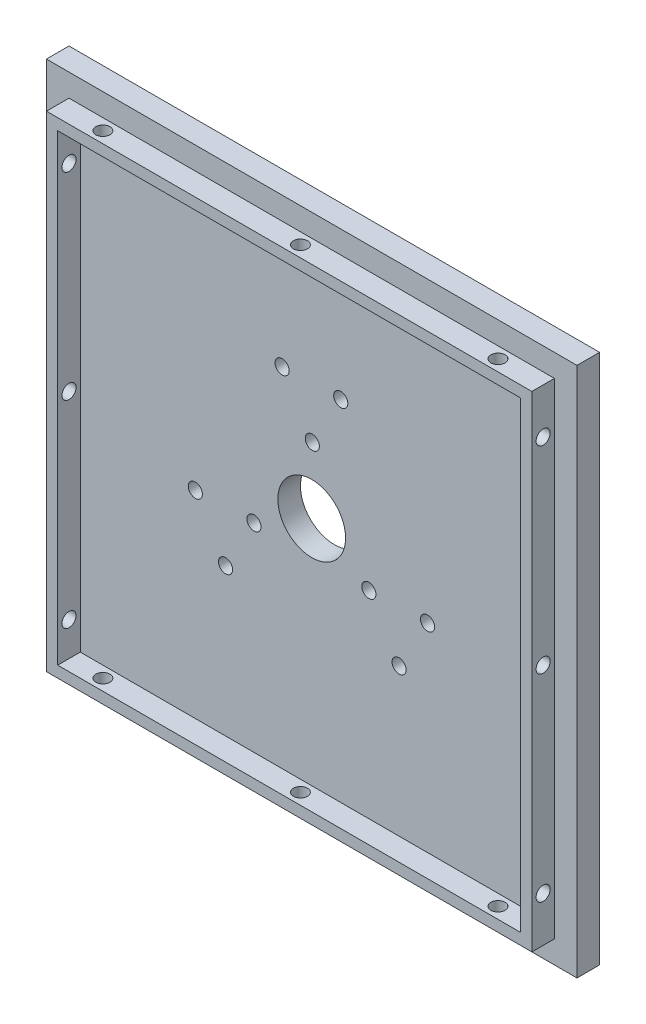
ISO-10303-21;
HEADER;
FILE_DESCRIPTION(('STEP AP214'),'2;1');
FILE_NAME('part.step','',(''),(''),'','','');
FILE_SCHEMA(('AUTOMOTIVE_DESIGN { 1 0 10303 214 1 1 1 1 }'));
ENDSEC;
DATA;
#1=APPLICATION_CONTEXT('core data for automotive mechanical design processes');
#2=APPLICATION_PROTOCOL_DEFINITION('international standard','automotive_design',2000,#1);
#3=PRODUCT_CONTEXT('',#1,'mechanical');
#4=PRODUCT('Part','Part','',(#3));
#5=PRODUCT_RELATED_PRODUCT_CATEGORY('part','',(#4));
#6=PRODUCT_DEFINITION_FORMATION('','',#4);
#7=PRODUCT_DEFINITION_CONTEXT('part definition',#1,'design');
#8=PRODUCT_DEFINITION('design','',#6,#7);
#9=PRODUCT_DEFINITION_SHAPE('','',#8);
#10=(LENGTH_UNIT() NAMED_UNIT(*) SI_UNIT(.MILLI.,.METRE.));
#11=(NAMED_UNIT(*) PLANE_ANGLE_UNIT() SI_UNIT($,.RADIAN.));
#12=(NAMED_UNIT(*) SI_UNIT($,.STERADIAN.) SOLID_ANGLE_UNIT());
#13=UNCERTAINTY_MEASURE_WITH_UNIT(LENGTH_MEASURE(1.E-05),#10,'distance_accuracy_value','');
#14=(GEOMETRIC_REPRESENTATION_CONTEXT(3) GLOBAL_UNCERTAINTY_ASSIGNED_CONTEXT((#13)) GLOBAL_UNIT_ASSIGNED_CONTEXT((#10,
#11,#12)) REPRESENTATION_CONTEXT('',''));
#15=CARTESIAN_POINT('',(0.,0.,0.));
#16=DIRECTION('',(0.,0.,1.));
#17=DIRECTION('',(1.,0.,0.));
#18=AXIS2_PLACEMENT_3D('',#15,#16,#17);
#19=CARTESIAN_POINT('',(0.,0.,4.));
#20=DIRECTION('',(0.,0.,1.));
#21=DIRECTION('',(1.,0.,0.));
#22=AXIS2_PLACEMENT_3D('',#19,#20,#21);
#23=PLANE('',#22);
#24=CARTESIAN_POINT('',(-10.2280810875576,-5.78427155053963,4.));
#25=DIRECTION('',(0.,0.,1.));
#26=DIRECTION('',(1.,0.,0.));
#27=AXIS2_PLACEMENT_3D('',#24,#25,#26);
#28=CIRCLE('',#27,1.25);
#29=CARTESIAN_POINT('',(-8.97808108755759,-5.78427155053963,4.));
#30=VERTEX_POINT('',#29);
#31=EDGE_CURVE('E198',#30,#30,#28,.T.);
#32=ORIENTED_EDGE('',*,*,#31,.F.);
#33=EDGE_LOOP('',(#32));
#34=FACE_BOUND('',#33,.T.);
#35=CARTESIAN_POINT('',(-20.6188031346063,-5.96564227852184,4.));
#36=DIRECTION('',(0.,0.,1.));
#37=DIRECTION('',(1.,0.,0.));
#38=AXIS2_PLACEMENT_3D('',#35,#36,#37);
#39=CIRCLE('',#38,1.25000000000001);
#40=CARTESIAN_POINT('',(-19.3688031346063,-5.96564227852184,4.));
#41=VERTEX_POINT('',#40);
#42=EDGE_CURVE('E201',#41,#41,#39,.T.);
#43=ORIENTED_EDGE('',*,*,#42,.F.);
#44=EDGE_LOOP('',(#43));
#45=FACE_BOUND('',#44,.T.);
#46=CARTESIAN_POINT('',(-15.2663704531465,-14.8735861709379,4.));
#47=DIRECTION('',(0.,0.,1.));
#48=DIRECTION('',(1.,0.,0.));
#49=AXIS2_PLACEMENT_3D('',#46,#47,#48);
#50=CIRCLE('',#49,1.25);
#51=CARTESIAN_POINT('',(-14.0163704531465,-14.8735861709379,4.));
#52=VERTEX_POINT('',#51);
#53=EDGE_CURVE('E205',#52,#52,#50,.T.);
#54=ORIENTED_EDGE('',*,*,#53,.F.);
#55=EDGE_LOOP('',(#54));
#56=FACE_BOUND('',#55,.T.);
#57=CARTESIAN_POINT('',(10.1233666489337,-5.96564227852231,4.));
#58=DIRECTION('',(0.,0.,1.));
#59=DIRECTION('',(1.,0.,0.));
#60=AXIS2_PLACEMENT_3D('',#57,#58,#59);
#61=CIRCLE('',#60,1.25);
#62=CARTESIAN_POINT('',(11.3733666489337,-5.96564227852231,4.));
#63=VERTEX_POINT('',#62);
#64=EDGE_CURVE('E208',#63,#63,#61,.T.);
#65=ORIENTED_EDGE('',*,*,#64,.F.);
#66=EDGE_LOOP('',(#65));
#67=FACE_BOUND('',#66,.T.);
#68=CARTESIAN_POINT('',(15.4757993303934,-14.8735861709385,4.));
#69=DIRECTION('',(0.,0.,1.));
#70=DIRECTION('',(1.,0.,0.));
#71=AXIS2_PLACEMENT_3D('',#68,#69,#70);
#72=CIRCLE('',#71,1.25);
#73=CARTESIAN_POINT('',(16.7257993303934,-14.8735861709385,4.));
#74=VERTEX_POINT('',#73);
#75=EDGE_CURVE('E211',#74,#74,#72,.T.);
#76=ORIENTED_EDGE('',*,*,#75,.F.);
#77=EDGE_LOOP('',(#76));
#78=FACE_BOUND('',#77,.T.);
#79=CARTESIAN_POINT('',(20.5140886959823,-5.78427155054022,4.));
#80=DIRECTION('',(0.,0.,1.));
#81=DIRECTION('',(1.,0.,0.));
#82=AXIS2_PLACEMENT_3D('',#79,#80,#81);
#83=CIRCLE('',#82,1.25);
#84=CARTESIAN_POINT('',(21.7640886959823,-5.78427155054022,4.));
#85=VERTEX_POINT('',#84);
#86=EDGE_CURVE('E214',#85,#85,#83,.T.);
#87=ORIENTED_EDGE('',*,*,#86,.F.);
#88=EDGE_LOOP('',(#87));
#89=FACE_BOUND('',#88,.T.);
#90=CARTESIAN_POINT('',(0.104714438623921,11.7499138290619,4.));
#91=DIRECTION('',(0.,0.,1.));
#92=DIRECTION('',(1.,0.,0.));
#93=AXIS2_PLACEMENT_3D('',#90,#91,#92);
#94=CIRCLE('',#93,1.25);
#95=CARTESIAN_POINT('',(1.35471443862392,11.7499138290619,4.));
#96=VERTEX_POINT('',#95);
#97=EDGE_CURVE('E217',#96,#96,#94,.T.);
#98=ORIENTED_EDGE('',*,*,#97,.F.);
#99=EDGE_LOOP('',(#98));
#100=FACE_BOUND('',#99,.T.);
#101=CARTESIAN_POINT('',(0.,0.,4.));
#102=DIRECTION('',(0.,0.,1.));
#103=DIRECTION('',(1.,0.,0.));
#104=AXIS2_PLACEMENT_3D('',#101,#102,#103);
#105=CIRCLE('',#104,6.);
#106=CARTESIAN_POINT('',(6.,0.,4.));
#107=VERTEX_POINT('',#106);
#108=EDGE_CURVE('E220',#107,#107,#105,.T.);
#109=ORIENTED_EDGE('',*,*,#108,.F.);
#110=EDGE_LOOP('',(#109));
#111=FACE_BOUND('',#110,.T.);
#112=CARTESIAN_POINT('',(5.14300380421285,20.8392284494601,4.));
#113=DIRECTION('',(0.,0.,1.));
#114=DIRECTION('',(1.,0.,0.));
#115=AXIS2_PLACEMENT_3D('',#112,#113,#114);
#116=CIRCLE('',#115,1.25000000000001);
#117=CARTESIAN_POINT('',(6.39300380421285,20.8392284494601,4.));
#118=VERTEX_POINT('',#117);
#119=EDGE_CURVE('E223',#118,#118,#116,.T.);
#120=ORIENTED_EDGE('',*,*,#119,.F.);
#121=EDGE_LOOP('',(#120));
#122=FACE_BOUND('',#121,.T.);
#123=CARTESIAN_POINT('',(-5.24771824283583,20.657857721478,4.));
#124=DIRECTION('',(0.,0.,1.));
#125=DIRECTION('',(1.,0.,0.));
#126=AXIS2_PLACEMENT_3D('',#123,#124,#125);
#127=CIRCLE('',#126,1.25);
#128=CARTESIAN_POINT('',(-3.99771824283582,20.657857721478,4.));
#129=VERTEX_POINT('',#128);
#130=EDGE_CURVE('E226',#129,#129,#127,.T.);
#131=ORIENTED_EDGE('',*,*,#130,.F.);
#132=EDGE_LOOP('',(#131));
#133=FACE_BOUND('',#132,.T.);
#134=DIRECTION('',(0.,-1.,0.));
#135=VECTOR('',#134,1.);
#136=CARTESIAN_POINT('',(41.,43.,4.0000000000002));
#137=LINE('',#136,#135);
#138=CARTESIAN_POINT('',(41.,41.,4.0000000000002));
#139=VERTEX_POINT('',#138);
#140=CARTESIAN_POINT('',(41.,-41.,4.0000000000002));
#141=VERTEX_POINT('',#140);
#142=EDGE_CURVE('E191',#139,#141,#137,.T.);
#143=ORIENTED_EDGE('',*,*,#142,.F.);
#144=DIRECTION('',(-1.,0.,0.));
#145=VECTOR('',#144,1.);
#146=CARTESIAN_POINT('',(43.,41.,4.));
#147=LINE('',#146,#145);
#148=CARTESIAN_POINT('',(-41.,41.,4.));
#149=VERTEX_POINT('',#148);
#150=EDGE_CURVE('E59',#139,#149,#147,.T.);
#151=ORIENTED_EDGE('',*,*,#150,.T.);
#152=DIRECTION('',(0.,-1.,0.));
#153=VECTOR('',#152,1.);
#154=CARTESIAN_POINT('',(-41.,43.,4.));
#155=LINE('',#154,#153);
#156=CARTESIAN_POINT('',(-41.,-41.,4.));
#157=VERTEX_POINT('',#156);
#158=EDGE_CURVE('E142',#149,#157,#155,.T.);
#159=ORIENTED_EDGE('',*,*,#158,.T.);
#160=DIRECTION('',(-1.,0.,0.));
#161=VECTOR('',#160,1.);
#162=CARTESIAN_POINT('',(43.,-41.,4.0000000000002));
#163=LINE('',#162,#161);
#164=EDGE_CURVE('E156',#141,#157,#163,.T.);
#165=ORIENTED_EDGE('',*,*,#164,.F.);
#166=EDGE_LOOP('',(#143,#151,#159,#165));
#167=FACE_BOUND('',#166,.T.);
#168=ADVANCED_FACE('F37',(#34,#45,#56,#67,#78,#89,#100,#111,#122,#133,#167),#23,.T.);
#169=DIRECTION('',(0.,1.,0.));
#170=VECTOR('',#169,1.);
#171=CARTESIAN_POINT('',(47.,0.,4.));
#172=LINE('',#171,#170);
#173=CARTESIAN_POINT('',(47.,-47.,4.));
#174=VERTEX_POINT('',#173);
#175=CARTESIAN_POINT('',(47.,47.,4.));
#176=VERTEX_POINT('',#175);
#177=EDGE_CURVE('E229',#174,#176,#172,.T.);
#178=ORIENTED_EDGE('',*,*,#177,.T.);
#179=DIRECTION('',(1.,0.,0.));
#180=VECTOR('',#179,1.);
#181=CARTESIAN_POINT('',(0.,47.,4.));
#182=LINE('',#181,#180);
#183=CARTESIAN_POINT('',(-47.,47.,4.));
#184=VERTEX_POINT('',#183);
#185=EDGE_CURVE('E231',#184,#176,#182,.T.);
#186=ORIENTED_EDGE('',*,*,#185,.F.);
#187=DIRECTION('',(0.,-1.,0.));
#188=VECTOR('',#187,1.);
#189=CARTESIAN_POINT('',(-47.,0.,4.));
#190=LINE('',#189,#188);
#191=CARTESIAN_POINT('',(-47.,-47.,4.));
#192=VERTEX_POINT('',#191);
#193=EDGE_CURVE('E234',#184,#192,#190,.T.);
#194=ORIENTED_EDGE('',*,*,#193,.T.);
#195=DIRECTION('',(-1.,0.,0.));
#196=VECTOR('',#195,1.);
#197=CARTESIAN_POINT('',(0.,-47.,4.));
#198=LINE('',#197,#196);
#199=EDGE_CURVE('E236',#174,#192,#198,.T.);
#200=ORIENTED_EDGE('',*,*,#199,.F.);
#201=EDGE_LOOP('',(#178,#186,#194,#200));
#202=FACE_BOUND('',#201,.T.);
#203=DIRECTION('',(0.,-1.,0.));
#204=VECTOR('',#203,1.);
#205=CARTESIAN_POINT('',(-43.,43.,4.));
#206=LINE('',#205,#204);
#207=CARTESIAN_POINT('',(-43.,43.,4.));
#208=VERTEX_POINT('',#207);
#209=CARTESIAN_POINT('',(-43.,-43.,4.));
#210=VERTEX_POINT('',#209);
#211=EDGE_CURVE('E170',#208,#210,#206,.T.);
#212=ORIENTED_EDGE('',*,*,#211,.F.);
#213=DIRECTION('',(-1.,0.,0.));
#214=VECTOR('',#213,1.);
#215=CARTESIAN_POINT('',(43.,43.,4.00000000000021));
#216=LINE('',#215,#214);
#217=CARTESIAN_POINT('',(43.,43.,4.00000000000021));
#218=VERTEX_POINT('',#217);
#219=EDGE_CURVE('E180',#218,#208,#216,.T.);
#220=ORIENTED_EDGE('',*,*,#219,.F.);
#221=DIRECTION('',(0.,-1.,0.));
#222=VECTOR('',#221,1.);
#223=CARTESIAN_POINT('',(43.,43.,4.00000000000021));
#224=LINE('',#223,#222);
#225=CARTESIAN_POINT('',(43.,-43.,4.00000000000021));
#226=VERTEX_POINT('',#225);
#227=EDGE_CURVE('E193',#218,#226,#224,.T.);
#228=ORIENTED_EDGE('',*,*,#227,.T.);
#229=DIRECTION('',(-1.,0.,0.));
#230=VECTOR('',#229,1.);
#231=CARTESIAN_POINT('',(43.,-43.,4.00000000000021));
#232=LINE('',#231,#230);
#233=EDGE_CURVE('E178',#226,#210,#232,.T.);
#234=ORIENTED_EDGE('',*,*,#233,.T.);
#235=EDGE_LOOP('',(#212,#220,#228,#234));
#236=FACE_BOUND('',#235,.T.);
#237=ADVANCED_FACE('F303',(#202,#236),#23,.T.);
#238=CARTESIAN_POINT('',(41.,43.,4.0000000000002));
#239=DIRECTION('',(1.,0.,0.));
#240=DIRECTION('',(0.,0.,-1.));
#241=AXIS2_PLACEMENT_3D('',#238,#239,#240);
#242=PLANE('',#241);
#243=CARTESIAN_POINT('',(40.9999999999997,35.0000000000004,6.0000000000003));
#244=DIRECTION('',(1.,0.,0.));
#245=DIRECTION('',(0.,0.,1.));
#246=AXIS2_PLACEMENT_3D('',#243,#244,#245);
#247=CIRCLE('',#246,1.25);
#248=CARTESIAN_POINT('',(40.9999999999997,35.0000000000004,7.25000000000029));
#249=VERTEX_POINT('',#248);
#250=EDGE_CURVE('E469',#249,#249,#247,.T.);
#251=ORIENTED_EDGE('',*,*,#250,.T.);
#252=EDGE_LOOP('',(#251));
#253=FACE_BOUND('',#252,.T.);
#254=CARTESIAN_POINT('',(41.0000000000004,-34.9999999999996,6.00000000000005));
#255=DIRECTION('',(1.,0.,0.));
#256=DIRECTION('',(0.,0.,1.));
#257=AXIS2_PLACEMENT_3D('',#254,#255,#256);
#258=CIRCLE('',#257,1.25);
#259=CARTESIAN_POINT('',(41.0000000000004,-34.9999999999996,7.25000000000005));
#260=VERTEX_POINT('',#259);
#261=EDGE_CURVE('E473',#260,#260,#258,.T.);
#262=ORIENTED_EDGE('',*,*,#261,.T.);
#263=EDGE_LOOP('',(#262));
#264=FACE_BOUND('',#263,.T.);
#265=CARTESIAN_POINT('',(41.,4.19043863821845E-13,6.00000000000005));
#266=DIRECTION('',(1.,0.,0.));
#267=DIRECTION('',(0.,0.,1.));
#268=AXIS2_PLACEMENT_3D('',#265,#266,#267);
#269=CIRCLE('',#268,1.25);
#270=CARTESIAN_POINT('',(41.,4.19043863821845E-13,7.25000000000005));
#271=VERTEX_POINT('',#270);
#272=EDGE_CURVE('E476',#271,#271,#269,.T.);
#273=ORIENTED_EDGE('',*,*,#272,.T.);
#274=EDGE_LOOP('',(#273));
#275=FACE_BOUND('',#274,.T.);
#276=DIRECTION('',(0.,0.,1.));
#277=VECTOR('',#276,1.);
#278=CARTESIAN_POINT('',(41.,41.,4.0000000000002));
#279=LINE('',#278,#277);
#280=CARTESIAN_POINT('',(41.,41.,8.0000000000002));
#281=VERTEX_POINT('',#280);
#282=EDGE_CURVE('E52',#139,#281,#279,.T.);
#283=ORIENTED_EDGE('',*,*,#282,.F.);
#284=ORIENTED_EDGE('',*,*,#142,.T.);
#285=DIRECTION('',(0.,0.,-1.));
#286=VECTOR('',#285,1.);
#287=CARTESIAN_POINT('',(41.,-41.,4.0000000000002));
#288=LINE('',#287,#286);
#289=CARTESIAN_POINT('',(41.,-41.,8.0000000000002));
#290=VERTEX_POINT('',#289);
#291=EDGE_CURVE('E161',#290,#141,#288,.T.);
#292=ORIENTED_EDGE('',*,*,#291,.F.);
#293=DIRECTION('',(0.,-1.,0.));
#294=VECTOR('',#293,1.);
#295=CARTESIAN_POINT('',(41.,43.,8.0000000000002));
#296=LINE('',#295,#294);
#297=EDGE_CURVE('E182',#281,#290,#296,.T.);
#298=ORIENTED_EDGE('',*,*,#297,.F.);
#299=EDGE_LOOP('',(#283,#284,#292,#298));
#300=FACE_BOUND('',#299,.T.);
#301=ADVANCED_FACE('F306',(#253,#264,#275,#300),#242,.F.);
#302=CARTESIAN_POINT('',(-41.,43.,4.));
#303=DIRECTION('',(-1.,0.,0.));
#304=DIRECTION('',(0.,0.,1.));
#305=AXIS2_PLACEMENT_3D('',#302,#303,#304);
#306=PLANE('',#305);
#307=CARTESIAN_POINT('',(-41.0000000000002,34.9999999999999,6.00000000000005));
#308=DIRECTION('',(-1.,0.,0.));
#309=DIRECTION('',(0.,0.,1.));
#310=AXIS2_PLACEMENT_3D('',#307,#308,#309);
#311=CIRCLE('',#310,1.25);
#312=CARTESIAN_POINT('',(-41.0000000000002,34.9999999999999,7.25000000000005));
#313=VERTEX_POINT('',#312);
#314=EDGE_CURVE('E495',#313,#313,#311,.T.);
#315=ORIENTED_EDGE('',*,*,#314,.T.);
#316=EDGE_LOOP('',(#315));
#317=FACE_BOUND('',#316,.T.);
#318=CARTESIAN_POINT('',(-40.9999999999999,-35.0000000000001,6.0000000000003));
#319=DIRECTION('',(-1.,0.,0.));
#320=DIRECTION('',(0.,0.,1.));
#321=AXIS2_PLACEMENT_3D('',#318,#319,#320);
#322=CIRCLE('',#321,1.25);
#323=CARTESIAN_POINT('',(-40.9999999999999,-35.0000000000001,7.25000000000029));
#324=VERTEX_POINT('',#323);
#325=EDGE_CURVE('E569',#324,#324,#322,.T.);
#326=ORIENTED_EDGE('',*,*,#325,.T.);
#327=EDGE_LOOP('',(#326));
#328=FACE_BOUND('',#327,.T.);
#329=CARTESIAN_POINT('',(-41.,-1.32742394036708E-13,6.00000000000005));
#330=DIRECTION('',(-1.,0.,0.));
#331=DIRECTION('',(0.,0.,1.));
#332=AXIS2_PLACEMENT_3D('',#329,#330,#331);
#333=CIRCLE('',#332,1.25);
#334=CARTESIAN_POINT('',(-41.,-1.32742394036708E-13,7.25000000000005));
#335=VERTEX_POINT('',#334);
#336=EDGE_CURVE('E488',#335,#335,#333,.T.);
#337=ORIENTED_EDGE('',*,*,#336,.T.);
#338=EDGE_LOOP('',(#337));
#339=FACE_BOUND('',#338,.T.);
#340=DIRECTION('',(0.,0.,-1.));
#341=VECTOR('',#340,1.);
#342=CARTESIAN_POINT('',(-41.,41.,4.00000000000001));
#343=LINE('',#342,#341);
#344=CARTESIAN_POINT('',(-41.,41.,8.0000000000002));
#345=VERTEX_POINT('',#344);
#346=EDGE_CURVE('E140',#345,#149,#343,.T.);
#347=ORIENTED_EDGE('',*,*,#346,.F.);
#348=DIRECTION('',(0.,-1.,0.));
#349=VECTOR('',#348,1.);
#350=CARTESIAN_POINT('',(-41.,43.,8.));
#351=LINE('',#350,#349);
#352=CARTESIAN_POINT('',(-41.,-41.,8.));
#353=VERTEX_POINT('',#352);
#354=EDGE_CURVE('E125',#345,#353,#351,.T.);
#355=ORIENTED_EDGE('',*,*,#354,.T.);
#356=DIRECTION('',(0.,0.,1.));
#357=VECTOR('',#356,1.);
#358=CARTESIAN_POINT('',(-41.,-41.,4.));
#359=LINE('',#358,#357);
#360=EDGE_CURVE('E159',#157,#353,#359,.T.);
#361=ORIENTED_EDGE('',*,*,#360,.F.);
#362=ORIENTED_EDGE('',*,*,#158,.F.);
#363=EDGE_LOOP('',(#347,#355,#361,#362));
#364=FACE_BOUND('',#363,.T.);
#365=ADVANCED_FACE('F141',(#317,#328,#339,#364),#306,.F.);
#366=CARTESIAN_POINT('',(47.,0.,4.));
#367=DIRECTION('',(-1.,0.,0.));
#368=DIRECTION('',(0.,0.,1.));
#369=AXIS2_PLACEMENT_3D('',#366,#367,#368);
#370=PLANE('',#369);
#371=DIRECTION('',(0.,1.,0.));
#372=VECTOR('',#371,1.);
#373=CARTESIAN_POINT('',(47.,0.,0.));
#374=LINE('',#373,#372);
#375=CARTESIAN_POINT('',(47.,-47.,0.));
#376=VERTEX_POINT('',#375);
#377=CARTESIAN_POINT('',(47.,47.,0.));
#378=VERTEX_POINT('',#377);
#379=EDGE_CURVE('E269',#376,#378,#374,.T.);
#380=ORIENTED_EDGE('',*,*,#379,.T.);
#381=DIRECTION('',(0.,0.,-1.));
#382=VECTOR('',#381,1.);
#383=CARTESIAN_POINT('',(47.,47.,4.));
#384=LINE('',#383,#382);
#385=EDGE_CURVE('E11',#176,#378,#384,.T.);
#386=ORIENTED_EDGE('',*,*,#385,.F.);
#387=ORIENTED_EDGE('',*,*,#177,.F.);
#388=DIRECTION('',(0.,0.,-1.));
#389=VECTOR('',#388,1.);
#390=CARTESIAN_POINT('',(47.,-47.,4.));
#391=LINE('',#390,#389);
#392=EDGE_CURVE('E239',#174,#376,#391,.T.);
#393=ORIENTED_EDGE('',*,*,#392,.T.);
#394=EDGE_LOOP('',(#380,#386,#387,#393));
#395=FACE_BOUND('',#394,.T.);
#396=ADVANCED_FACE('F298',(#395),#370,.F.);
#397=CARTESIAN_POINT('',(0.,47.,4.));
#398=DIRECTION('',(0.,1.,0.));
#399=DIRECTION('',(0.,0.,1.));
#400=AXIS2_PLACEMENT_3D('',#397,#398,#399);
#401=PLANE('',#400);
#402=DIRECTION('',(1.,0.,0.));
#403=VECTOR('',#402,1.);
#404=CARTESIAN_POINT('',(0.,47.,0.));
#405=LINE('',#404,#403);
#406=CARTESIAN_POINT('',(-47.,47.,0.));
#407=VERTEX_POINT('',#406);
#408=EDGE_CURVE('E272',#407,#378,#405,.T.);
#409=ORIENTED_EDGE('',*,*,#408,.F.);
#410=DIRECTION('',(0.,0.,-1.));
#411=VECTOR('',#410,1.);
#412=CARTESIAN_POINT('',(-47.,47.,4.));
#413=LINE('',#412,#411);
#414=EDGE_CURVE('E45',#184,#407,#413,.T.);
#415=ORIENTED_EDGE('',*,*,#414,.F.);
#416=ORIENTED_EDGE('',*,*,#185,.T.);
#417=ORIENTED_EDGE('',*,*,#385,.T.);
#418=EDGE_LOOP('',(#409,#415,#416,#417));
#419=FACE_BOUND('',#418,.T.);
#420=ADVANCED_FACE('F294',(#419),#401,.T.);
#421=CARTESIAN_POINT('',(-47.,0.,4.));
#422=DIRECTION('',(1.,0.,0.));
#423=DIRECTION('',(0.,0.,-1.));
#424=AXIS2_PLACEMENT_3D('',#421,#422,#423);
#425=PLANE('',#424);
#426=DIRECTION('',(0.,-1.,0.));
#427=VECTOR('',#426,1.);
#428=CARTESIAN_POINT('',(-47.,0.,0.));
#429=LINE('',#428,#427);
#430=CARTESIAN_POINT('',(-47.,-47.,0.));
#431=VERTEX_POINT('',#430);
#432=EDGE_CURVE('E275',#407,#431,#429,.T.);
#433=ORIENTED_EDGE('',*,*,#432,.T.);
#434=DIRECTION('',(0.,0.,-1.));
#435=VECTOR('',#434,1.);
#436=CARTESIAN_POINT('',(-47.,-47.,4.));
#437=LINE('',#436,#435);
#438=EDGE_CURVE('E281',#192,#431,#437,.T.);
#439=ORIENTED_EDGE('',*,*,#438,.F.);
#440=ORIENTED_EDGE('',*,*,#193,.F.);
#441=ORIENTED_EDGE('',*,*,#414,.T.);
#442=EDGE_LOOP('',(#433,#439,#440,#441));
#443=FACE_BOUND('',#442,.T.);
#444=ADVANCED_FACE('F285',(#443),#425,.F.);
#445=CARTESIAN_POINT('',(-5.24771824283583,20.657857721478,4.));
#446=DIRECTION('',(0.,0.,-1.));
#447=DIRECTION('',(-1.,0.,0.));
#448=AXIS2_PLACEMENT_3D('',#445,#446,#447);
#449=CYLINDRICAL_SURFACE('',#448,1.25);
#450=ORIENTED_EDGE('',*,*,#130,.T.);
#451=EDGE_LOOP('',(#450));
#452=FACE_BOUND('',#451,.T.);
#453=CARTESIAN_POINT('',(-5.24771824283583,20.657857721478,0.));
#454=DIRECTION('',(0.,0.,1.));
#455=DIRECTION('',(1.,0.,0.));
#456=AXIS2_PLACEMENT_3D('',#453,#454,#455);
#457=CIRCLE('',#456,1.25);
#458=CARTESIAN_POINT('',(-3.99771824283582,20.657857721478,0.));
#459=VERTEX_POINT('',#458);
#460=EDGE_CURVE('E266',#459,#459,#457,.T.);
#461=ORIENTED_EDGE('',*,*,#460,.F.);
#462=EDGE_LOOP('',(#461));
#463=FACE_BOUND('',#462,.T.);
#464=ADVANCED_FACE('F347',(#452,#463),#449,.F.);
#465=CARTESIAN_POINT('',(5.14300380421285,20.8392284494601,4.));
#466=DIRECTION('',(0.,0.,-1.));
#467=DIRECTION('',(-1.,0.,0.));
#468=AXIS2_PLACEMENT_3D('',#465,#466,#467);
#469=CYLINDRICAL_SURFACE('',#468,1.25000000000001);
#470=ORIENTED_EDGE('',*,*,#119,.T.);
#471=EDGE_LOOP('',(#470));
#472=FACE_BOUND('',#471,.T.);
#473=CARTESIAN_POINT('',(5.14300380421285,20.8392284494601,0.));
#474=DIRECTION('',(0.,0.,1.));
#475=DIRECTION('',(1.,0.,0.));
#476=AXIS2_PLACEMENT_3D('',#473,#474,#475);
#477=CIRCLE('',#476,1.25000000000001);
#478=CARTESIAN_POINT('',(6.39300380421285,20.8392284494601,0.));
#479=VERTEX_POINT('',#478);
#480=EDGE_CURVE('E263',#479,#479,#477,.T.);
#481=ORIENTED_EDGE('',*,*,#480,.F.);
#482=EDGE_LOOP('',(#481));
#483=FACE_BOUND('',#482,.T.);
#484=ADVANCED_FACE('F354',(#472,#483),#469,.F.);
#485=CARTESIAN_POINT('',(0.,0.,4.));
#486=DIRECTION('',(0.,0.,-1.));
#487=DIRECTION('',(-1.,0.,0.));
#488=AXIS2_PLACEMENT_3D('',#485,#486,#487);
#489=CYLINDRICAL_SURFACE('',#488,6.);
#490=ORIENTED_EDGE('',*,*,#108,.T.);
#491=EDGE_LOOP('',(#490));
#492=FACE_BOUND('',#491,.T.);
#493=CARTESIAN_POINT('',(0.,0.,0.));
#494=DIRECTION('',(0.,0.,1.));
#495=DIRECTION('',(1.,0.,0.));
#496=AXIS2_PLACEMENT_3D('',#493,#494,#495);
#497=CIRCLE('',#496,6.);
#498=CARTESIAN_POINT('',(6.,0.,0.));
#499=VERTEX_POINT('',#498);
#500=EDGE_CURVE('E260',#499,#499,#497,.T.);
#501=ORIENTED_EDGE('',*,*,#500,.F.);
#502=EDGE_LOOP('',(#501));
#503=FACE_BOUND('',#502,.T.);
#504=ADVANCED_FACE('F358',(#492,#503),#489,.F.);
#505=CARTESIAN_POINT('',(0.104714438623921,11.7499138290619,4.));
#506=DIRECTION('',(0.,0.,-1.));
#507=DIRECTION('',(-1.,0.,0.));
#508=AXIS2_PLACEMENT_3D('',#505,#506,#507);
#509=CYLINDRICAL_SURFACE('',#508,1.25);
#510=ORIENTED_EDGE('',*,*,#97,.T.);
#511=EDGE_LOOP('',(#510));
#512=FACE_BOUND('',#511,.T.);
#513=CARTESIAN_POINT('',(0.104714438623921,11.7499138290619,0.));
#514=DIRECTION('',(0.,0.,1.));
#515=DIRECTION('',(1.,0.,0.));
#516=AXIS2_PLACEMENT_3D('',#513,#514,#515);
#517=CIRCLE('',#516,1.25);
#518=CARTESIAN_POINT('',(1.35471443862392,11.7499138290619,0.));
#519=VERTEX_POINT('',#518);
#520=EDGE_CURVE('E257',#519,#519,#517,.T.);
#521=ORIENTED_EDGE('',*,*,#520,.F.);
#522=EDGE_LOOP('',(#521));
#523=FACE_BOUND('',#522,.T.);
#524=ADVANCED_FACE('F362',(#512,#523),#509,.F.);
#525=CARTESIAN_POINT('',(20.5140886959823,-5.78427155054022,4.));
#526=DIRECTION('',(0.,0.,-1.));
#527=DIRECTION('',(-1.,0.,0.));
#528=AXIS2_PLACEMENT_3D('',#525,#526,#527);
#529=CYLINDRICAL_SURFACE('',#528,1.25);
#530=ORIENTED_EDGE('',*,*,#86,.T.);
#531=EDGE_LOOP('',(#530));
#532=FACE_BOUND('',#531,.T.);
#533=CARTESIAN_POINT('',(20.5140886959823,-5.78427155054022,0.));
#534=DIRECTION('',(0.,0.,1.));
#535=DIRECTION('',(1.,0.,0.));
#536=AXIS2_PLACEMENT_3D('',#533,#534,#535);
#537=CIRCLE('',#536,1.25);
#538=CARTESIAN_POINT('',(21.7640886959823,-5.78427155054022,0.));
#539=VERTEX_POINT('',#538);
#540=EDGE_CURVE('E254',#539,#539,#537,.T.);
#541=ORIENTED_EDGE('',*,*,#540,.F.);
#542=EDGE_LOOP('',(#541));
#543=FACE_BOUND('',#542,.T.);
#544=ADVANCED_FACE('F366',(#532,#543),#529,.F.);
#545=CARTESIAN_POINT('',(15.4757993303934,-14.8735861709385,4.));
#546=DIRECTION('',(0.,0.,-1.));
#547=DIRECTION('',(-1.,0.,0.));
#548=AXIS2_PLACEMENT_3D('',#545,#546,#547);
#549=CYLINDRICAL_SURFACE('',#548,1.25);
#550=ORIENTED_EDGE('',*,*,#75,.T.);
#551=EDGE_LOOP('',(#550));
#552=FACE_BOUND('',#551,.T.);
#553=CARTESIAN_POINT('',(15.4757993303934,-14.8735861709385,0.));
#554=DIRECTION('',(0.,0.,1.));
#555=DIRECTION('',(1.,0.,0.));
#556=AXIS2_PLACEMENT_3D('',#553,#554,#555);
#557=CIRCLE('',#556,1.25);
#558=CARTESIAN_POINT('',(16.7257993303934,-14.8735861709385,0.));
#559=VERTEX_POINT('',#558);
#560=EDGE_CURVE('E251',#559,#559,#557,.T.);
#561=ORIENTED_EDGE('',*,*,#560,.F.);
#562=EDGE_LOOP('',(#561));
#563=FACE_BOUND('',#562,.T.);
#564=ADVANCED_FACE('F370',(#552,#563),#549,.F.);
#565=CARTESIAN_POINT('',(10.1233666489337,-5.96564227852231,4.));
#566=DIRECTION('',(0.,0.,-1.));
#567=DIRECTION('',(-1.,0.,0.));
#568=AXIS2_PLACEMENT_3D('',#565,#566,#567);
#569=CYLINDRICAL_SURFACE('',#568,1.25);
#570=ORIENTED_EDGE('',*,*,#64,.T.);
#571=EDGE_LOOP('',(#570));
#572=FACE_BOUND('',#571,.T.);
#573=CARTESIAN_POINT('',(10.1233666489337,-5.96564227852231,0.));
#574=DIRECTION('',(0.,0.,1.));
#575=DIRECTION('',(1.,0.,0.));
#576=AXIS2_PLACEMENT_3D('',#573,#574,#575);
#577=CIRCLE('',#576,1.25);
#578=CARTESIAN_POINT('',(11.3733666489337,-5.96564227852231,0.));
#579=VERTEX_POINT('',#578);
#580=EDGE_CURVE('E248',#579,#579,#577,.T.);
#581=ORIENTED_EDGE('',*,*,#580,.F.);
#582=EDGE_LOOP('',(#581));
#583=FACE_BOUND('',#582,.T.);
#584=ADVANCED_FACE('F374',(#572,#583),#569,.F.);
#585=CARTESIAN_POINT('',(-15.2663704531465,-14.8735861709379,4.));
#586=DIRECTION('',(0.,0.,-1.));
#587=DIRECTION('',(-1.,0.,0.));
#588=AXIS2_PLACEMENT_3D('',#585,#586,#587);
#589=CYLINDRICAL_SURFACE('',#588,1.25);
#590=ORIENTED_EDGE('',*,*,#53,.T.);
#591=EDGE_LOOP('',(#590));
#592=FACE_BOUND('',#591,.T.);
#593=CARTESIAN_POINT('',(-15.2663704531465,-14.8735861709379,0.));
#594=DIRECTION('',(0.,0.,1.));
#595=DIRECTION('',(1.,0.,0.));
#596=AXIS2_PLACEMENT_3D('',#593,#594,#595);
#597=CIRCLE('',#596,1.25);
#598=CARTESIAN_POINT('',(-14.0163704531465,-14.8735861709379,0.));
#599=VERTEX_POINT('',#598);
#600=EDGE_CURVE('E245',#599,#599,#597,.T.);
#601=ORIENTED_EDGE('',*,*,#600,.F.);
#602=EDGE_LOOP('',(#601));
#603=FACE_BOUND('',#602,.T.);
#604=ADVANCED_FACE('F378',(#592,#603),#589,.F.);
#605=CARTESIAN_POINT('',(-20.6188031346063,-5.96564227852184,4.));
#606=DIRECTION('',(0.,0.,-1.));
#607=DIRECTION('',(-1.,0.,0.));
#608=AXIS2_PLACEMENT_3D('',#605,#606,#607);
#609=CYLINDRICAL_SURFACE('',#608,1.25000000000001);
#610=ORIENTED_EDGE('',*,*,#42,.T.);
#611=EDGE_LOOP('',(#610));
#612=FACE_BOUND('',#611,.T.);
#613=CARTESIAN_POINT('',(-20.6188031346063,-5.96564227852184,0.));
#614=DIRECTION('',(0.,0.,1.));
#615=DIRECTION('',(1.,0.,0.));
#616=AXIS2_PLACEMENT_3D('',#613,#614,#615);
#617=CIRCLE('',#616,1.25000000000001);
#618=CARTESIAN_POINT('',(-19.3688031346063,-5.96564227852184,0.));
#619=VERTEX_POINT('',#618);
#620=EDGE_CURVE('E242',#619,#619,#617,.T.);
#621=ORIENTED_EDGE('',*,*,#620,.F.);
#622=EDGE_LOOP('',(#621));
#623=FACE_BOUND('',#622,.T.);
#624=ADVANCED_FACE('F381',(#612,#623),#609,.F.);
#625=CARTESIAN_POINT('',(-10.2280810875576,-5.78427155053963,4.));
#626=DIRECTION('',(0.,0.,-1.));
#627=DIRECTION('',(-1.,0.,0.));
#628=AXIS2_PLACEMENT_3D('',#625,#626,#627);
#629=CYLINDRICAL_SURFACE('',#628,1.25);
#630=ORIENTED_EDGE('',*,*,#31,.T.);
#631=EDGE_LOOP('',(#630));
#632=FACE_BOUND('',#631,.T.);
#633=CARTESIAN_POINT('',(-10.2280810875576,-5.78427155053963,0.));
#634=DIRECTION('',(0.,0.,1.));
#635=DIRECTION('',(1.,0.,0.));
#636=AXIS2_PLACEMENT_3D('',#633,#634,#635);
#637=CIRCLE('',#636,1.25);
#638=CARTESIAN_POINT('',(-8.97808108755759,-5.78427155053963,0.));
#639=VERTEX_POINT('',#638);
#640=EDGE_CURVE('E197',#639,#639,#637,.T.);
#641=ORIENTED_EDGE('',*,*,#640,.F.);
#642=EDGE_LOOP('',(#641));
#643=FACE_BOUND('',#642,.T.);
#644=ADVANCED_FACE('F39',(#632,#643),#629,.F.);
#645=CARTESIAN_POINT('',(0.,-47.,4.));
#646=DIRECTION('',(0.,-1.,0.));
#647=DIRECTION('',(0.,0.,-1.));
#648=AXIS2_PLACEMENT_3D('',#645,#646,#647);
#649=PLANE('',#648);
#650=DIRECTION('',(-1.,0.,0.));
#651=VECTOR('',#650,1.);
#652=CARTESIAN_POINT('',(0.,-47.,0.));
#653=LINE('',#652,#651);
#654=EDGE_CURVE('E202',#376,#431,#653,.T.);
#655=ORIENTED_EDGE('',*,*,#654,.F.);
#656=ORIENTED_EDGE('',*,*,#392,.F.);
#657=ORIENTED_EDGE('',*,*,#199,.T.);
#658=ORIENTED_EDGE('',*,*,#438,.T.);
#659=EDGE_LOOP('',(#655,#656,#657,#658));
#660=FACE_BOUND('',#659,.T.);
#661=ADVANCED_FACE('F300',(#660),#649,.T.);
#662=CARTESIAN_POINT('',(0.,0.,0.));
#663=DIRECTION('',(0.,0.,1.));
#664=DIRECTION('',(1.,0.,0.));
#665=AXIS2_PLACEMENT_3D('',#662,#663,#664);
#666=PLANE('',#665);
#667=ORIENTED_EDGE('',*,*,#640,.T.);
#668=EDGE_LOOP('',(#667));
#669=FACE_BOUND('',#668,.T.);
#670=ORIENTED_EDGE('',*,*,#620,.T.);
#671=EDGE_LOOP('',(#670));
#672=FACE_BOUND('',#671,.T.);
#673=ORIENTED_EDGE('',*,*,#600,.T.);
#674=EDGE_LOOP('',(#673));
#675=FACE_BOUND('',#674,.T.);
#676=ORIENTED_EDGE('',*,*,#580,.T.);
#677=EDGE_LOOP('',(#676));
#678=FACE_BOUND('',#677,.T.);
#679=ORIENTED_EDGE('',*,*,#560,.T.);
#680=EDGE_LOOP('',(#679));
#681=FACE_BOUND('',#680,.T.);
#682=ORIENTED_EDGE('',*,*,#540,.T.);
#683=EDGE_LOOP('',(#682));
#684=FACE_BOUND('',#683,.T.);
#685=ORIENTED_EDGE('',*,*,#520,.T.);
#686=EDGE_LOOP('',(#685));
#687=FACE_BOUND('',#686,.T.);
#688=ORIENTED_EDGE('',*,*,#500,.T.);
#689=EDGE_LOOP('',(#688));
#690=FACE_BOUND('',#689,.T.);
#691=ORIENTED_EDGE('',*,*,#480,.T.);
#692=EDGE_LOOP('',(#691));
#693=FACE_BOUND('',#692,.T.);
#694=ORIENTED_EDGE('',*,*,#460,.T.);
#695=EDGE_LOOP('',(#694));
#696=FACE_BOUND('',#695,.T.);
#697=ORIENTED_EDGE('',*,*,#379,.F.);
#698=ORIENTED_EDGE('',*,*,#654,.T.);
#699=ORIENTED_EDGE('',*,*,#432,.F.);
#700=ORIENTED_EDGE('',*,*,#408,.T.);
#701=EDGE_LOOP('',(#697,#698,#699,#700));
#702=FACE_BOUND('',#701,.T.);
#703=ADVANCED_FACE('F292',(#669,#672,#675,#678,#681,#684,#687,#690,#693,#696,#702),#666,.F.);
#704=CARTESIAN_POINT('',(41.,43.,8.0000000000002));
#705=DIRECTION('',(0.,0.,-1.));
#706=DIRECTION('',(-1.,0.,0.));
#707=AXIS2_PLACEMENT_3D('',#704,#705,#706);
#708=PLANE('',#707);
#709=DIRECTION('',(-1.,0.,0.));
#710=VECTOR('',#709,1.);
#711=CARTESIAN_POINT('',(43.,41.,8.0000000000002));
#712=LINE('',#711,#710);
#713=EDGE_CURVE('E130',#281,#345,#712,.T.);
#714=ORIENTED_EDGE('',*,*,#713,.F.);
#715=ORIENTED_EDGE('',*,*,#297,.T.);
#716=DIRECTION('',(-1.,0.,0.));
#717=VECTOR('',#716,1.);
#718=CARTESIAN_POINT('',(43.,-41.,8.0000000000002));
#719=LINE('',#718,#717);
#720=EDGE_CURVE('E132',#290,#353,#719,.T.);
#721=ORIENTED_EDGE('',*,*,#720,.T.);
#722=ORIENTED_EDGE('',*,*,#354,.F.);
#723=EDGE_LOOP('',(#714,#715,#721,#722));
#724=FACE_BOUND('',#723,.T.);
#725=DIRECTION('',(1.,0.,0.));
#726=VECTOR('',#725,1.);
#727=CARTESIAN_POINT('',(41.,43.,8.0000000000002));
#728=LINE('',#727,#726);
#729=CARTESIAN_POINT('',(-43.,43.,8.));
#730=VERTEX_POINT('',#729);
#731=CARTESIAN_POINT('',(43.,43.,8.0000000000002));
#732=VERTEX_POINT('',#731);
#733=EDGE_CURVE('E174',#730,#732,#728,.T.);
#734=ORIENTED_EDGE('',*,*,#733,.F.);
#735=DIRECTION('',(0.,-1.,0.));
#736=VECTOR('',#735,1.);
#737=CARTESIAN_POINT('',(-43.,43.,8.));
#738=LINE('',#737,#736);
#739=CARTESIAN_POINT('',(-43.,-43.,8.));
#740=VERTEX_POINT('',#739);
#741=EDGE_CURVE('E136',#730,#740,#738,.T.);
#742=ORIENTED_EDGE('',*,*,#741,.T.);
#743=DIRECTION('',(1.,0.,0.));
#744=VECTOR('',#743,1.);
#745=CARTESIAN_POINT('',(41.,-43.,8.0000000000002));
#746=LINE('',#745,#744);
#747=CARTESIAN_POINT('',(43.,-43.,8.0000000000002));
#748=VERTEX_POINT('',#747);
#749=EDGE_CURVE('E173',#740,#748,#746,.T.);
#750=ORIENTED_EDGE('',*,*,#749,.T.);
#751=DIRECTION('',(0.,-1.,0.));
#752=VECTOR('',#751,1.);
#753=CARTESIAN_POINT('',(43.,43.,8.0000000000002));
#754=LINE('',#753,#752);
#755=EDGE_CURVE('E195',#732,#748,#754,.T.);
#756=ORIENTED_EDGE('',*,*,#755,.F.);
#757=EDGE_LOOP('',(#734,#742,#750,#756));
#758=FACE_BOUND('',#757,.T.);
#759=ADVANCED_FACE('F127',(#724,#758),#708,.F.);
#760=CARTESIAN_POINT('',(43.,43.,8.0000000000002));
#761=DIRECTION('',(-1.,0.,0.));
#762=DIRECTION('',(0.,0.,1.));
#763=AXIS2_PLACEMENT_3D('',#760,#761,#762);
#764=PLANE('',#763);
#765=CARTESIAN_POINT('',(42.9999999999996,35.0000000000004,6.0000000000003));
#766=DIRECTION('',(1.,0.,0.));
#767=DIRECTION('',(0.,0.,1.));
#768=AXIS2_PLACEMENT_3D('',#765,#766,#767);
#769=CIRCLE('',#768,1.25);
#770=CARTESIAN_POINT('',(42.9999999999996,35.0000000000004,7.25000000000029));
#771=VERTEX_POINT('',#770);
#772=EDGE_CURVE('E594',#771,#771,#769,.T.);
#773=ORIENTED_EDGE('',*,*,#772,.F.);
#774=EDGE_LOOP('',(#773));
#775=FACE_BOUND('',#774,.T.);
#776=CARTESIAN_POINT('',(43.0000000000004,-34.9999999999996,6.00000000000005));
#777=DIRECTION('',(1.,0.,0.));
#778=DIRECTION('',(0.,0.,1.));
#779=AXIS2_PLACEMENT_3D('',#776,#777,#778);
#780=CIRCLE('',#779,1.25);
#781=CARTESIAN_POINT('',(43.0000000000004,-34.9999999999996,7.25000000000005));
#782=VERTEX_POINT('',#781);
#783=EDGE_CURVE('E590',#782,#782,#780,.T.);
#784=ORIENTED_EDGE('',*,*,#783,.F.);
#785=EDGE_LOOP('',(#784));
#786=FACE_BOUND('',#785,.T.);
#787=CARTESIAN_POINT('',(43.,4.39992751854903E-13,6.00000000000005));
#788=DIRECTION('',(1.,0.,0.));
#789=DIRECTION('',(0.,0.,1.));
#790=AXIS2_PLACEMENT_3D('',#787,#788,#789);
#791=CIRCLE('',#790,1.25);
#792=CARTESIAN_POINT('',(43.,4.39992751854903E-13,7.25000000000005));
#793=VERTEX_POINT('',#792);
#794=EDGE_CURVE('E479',#793,#793,#791,.T.);
#795=ORIENTED_EDGE('',*,*,#794,.F.);
#796=EDGE_LOOP('',(#795));
#797=FACE_BOUND('',#796,.T.);
#798=ORIENTED_EDGE('',*,*,#755,.T.);
#799=DIRECTION('',(0.,0.,-1.));
#800=VECTOR('',#799,1.);
#801=CARTESIAN_POINT('',(43.,-43.,8.0000000000002));
#802=LINE('',#801,#800);
#803=EDGE_CURVE('E185',#748,#226,#802,.T.);
#804=ORIENTED_EDGE('',*,*,#803,.T.);
#805=ORIENTED_EDGE('',*,*,#227,.F.);
#806=DIRECTION('',(0.,0.,-1.));
#807=VECTOR('',#806,1.);
#808=CARTESIAN_POINT('',(43.,43.,8.0000000000002));
#809=LINE('',#808,#807);
#810=EDGE_CURVE('E177',#732,#218,#809,.T.);
#811=ORIENTED_EDGE('',*,*,#810,.F.);
#812=EDGE_LOOP('',(#798,#804,#805,#811));
#813=FACE_BOUND('',#812,.T.);
#814=ADVANCED_FACE('F321',(#775,#786,#797,#813),#764,.F.);
#815=CARTESIAN_POINT('',(0.,43.,0.));
#816=DIRECTION('',(0.,1.,0.));
#817=DIRECTION('',(0.,0.,1.));
#818=AXIS2_PLACEMENT_3D('',#815,#816,#817);
#819=PLANE('',#818);
#820=CARTESIAN_POINT('',(35.,43.,6.00000000000005));
#821=DIRECTION('',(0.,1.,0.));
#822=DIRECTION('',(0.,0.,1.));
#823=AXIS2_PLACEMENT_3D('',#820,#821,#822);
#824=CIRCLE('',#823,1.25);
#825=CARTESIAN_POINT('',(35.,43.,7.25000000000005));
#826=VERTEX_POINT('',#825);
#827=EDGE_CURVE('E499',#826,#826,#824,.T.);
#828=ORIENTED_EDGE('',*,*,#827,.F.);
#829=EDGE_LOOP('',(#828));
#830=FACE_BOUND('',#829,.T.);
#831=CARTESIAN_POINT('',(-35.,43.,6.0000000000003));
#832=DIRECTION('',(0.,1.,0.));
#833=DIRECTION('',(0.,0.,1.));
#834=AXIS2_PLACEMENT_3D('',#831,#832,#833);
#835=CIRCLE('',#834,1.25);
#836=CARTESIAN_POINT('',(-35.,43.,7.25000000000029));
#837=VERTEX_POINT('',#836);
#838=EDGE_CURVE('E491',#837,#837,#835,.T.);
#839=ORIENTED_EDGE('',*,*,#838,.F.);
#840=EDGE_LOOP('',(#839));
#841=FACE_BOUND('',#840,.T.);
#842=CARTESIAN_POINT('',(0.,43.,6.00000000000005));
#843=DIRECTION('',(0.,1.,0.));
#844=DIRECTION('',(0.,0.,1.));
#845=AXIS2_PLACEMENT_3D('',#842,#843,#844);
#846=CIRCLE('',#845,1.25);
#847=CARTESIAN_POINT('',(0.,43.,7.25000000000005));
#848=VERTEX_POINT('',#847);
#849=EDGE_CURVE('E150',#848,#848,#846,.T.);
#850=ORIENTED_EDGE('',*,*,#849,.F.);
#851=EDGE_LOOP('',(#850));
#852=FACE_BOUND('',#851,.T.);
#853=ORIENTED_EDGE('',*,*,#733,.T.);
#854=ORIENTED_EDGE('',*,*,#810,.T.);
#855=ORIENTED_EDGE('',*,*,#219,.T.);
#856=DIRECTION('',(0.,0.,1.));
#857=VECTOR('',#856,1.);
#858=CARTESIAN_POINT('',(-43.,43.,8.));
#859=LINE('',#858,#857);
#860=EDGE_CURVE('E137',#208,#730,#859,.T.);
#861=ORIENTED_EDGE('',*,*,#860,.T.);
#862=EDGE_LOOP('',(#853,#854,#855,#861));
#863=FACE_BOUND('',#862,.T.);
#864=ADVANCED_FACE('F317',(#830,#841,#852,#863),#819,.T.);
#865=CARTESIAN_POINT('',(0.,-43.,0.));
#866=DIRECTION('',(0.,1.,0.));
#867=DIRECTION('',(0.,0.,1.));
#868=AXIS2_PLACEMENT_3D('',#865,#866,#867);
#869=PLANE('',#868);
#870=CARTESIAN_POINT('',(0.,-43.,6.00000000000005));
#871=DIRECTION('',(0.,-1.,0.));
#872=DIRECTION('',(0.,0.,1.));
#873=AXIS2_PLACEMENT_3D('',#870,#871,#872);
#874=CIRCLE('',#873,1.25);
#875=CARTESIAN_POINT('',(0.,-43.,7.25000000000005));
#876=VERTEX_POINT('',#875);
#877=EDGE_CURVE('E580',#876,#876,#874,.T.);
#878=ORIENTED_EDGE('',*,*,#877,.F.);
#879=EDGE_LOOP('',(#878));
#880=FACE_BOUND('',#879,.T.);
#881=CARTESIAN_POINT('',(-35.,-43.,6.00000000000005));
#882=DIRECTION('',(0.,-1.,0.));
#883=DIRECTION('',(0.,0.,1.));
#884=AXIS2_PLACEMENT_3D('',#881,#882,#883);
#885=CIRCLE('',#884,1.25);
#886=CARTESIAN_POINT('',(-35.,-43.,7.25000000000005));
#887=VERTEX_POINT('',#886);
#888=EDGE_CURVE('E586',#887,#887,#885,.T.);
#889=ORIENTED_EDGE('',*,*,#888,.F.);
#890=EDGE_LOOP('',(#889));
#891=FACE_BOUND('',#890,.T.);
#892=CARTESIAN_POINT('',(35.,-43.,6.0000000000003));
#893=DIRECTION('',(0.,-1.,0.));
#894=DIRECTION('',(0.,0.,1.));
#895=AXIS2_PLACEMENT_3D('',#892,#893,#894);
#896=CIRCLE('',#895,1.25);
#897=CARTESIAN_POINT('',(35.,-43.,7.25000000000029));
#898=VERTEX_POINT('',#897);
#899=EDGE_CURVE('E478',#898,#898,#896,.T.);
#900=ORIENTED_EDGE('',*,*,#899,.F.);
#901=EDGE_LOOP('',(#900));
#902=FACE_BOUND('',#901,.T.);
#903=ORIENTED_EDGE('',*,*,#749,.F.);
#904=DIRECTION('',(0.,0.,1.));
#905=VECTOR('',#904,1.);
#906=CARTESIAN_POINT('',(-43.,-43.,8.));
#907=LINE('',#906,#905);
#908=EDGE_CURVE('E164',#210,#740,#907,.T.);
#909=ORIENTED_EDGE('',*,*,#908,.F.);
#910=ORIENTED_EDGE('',*,*,#233,.F.);
#911=ORIENTED_EDGE('',*,*,#803,.F.);
#912=EDGE_LOOP('',(#903,#909,#910,#911));
#913=FACE_BOUND('',#912,.T.);
#914=ADVANCED_FACE('F325',(#880,#891,#902,#913),#869,.F.);
#915=CARTESIAN_POINT('',(-43.,43.,8.));
#916=DIRECTION('',(1.,0.,0.));
#917=DIRECTION('',(0.,0.,-1.));
#918=AXIS2_PLACEMENT_3D('',#915,#916,#917);
#919=PLANE('',#918);
#920=CARTESIAN_POINT('',(-43.0000000000001,34.9999999999999,6.00000000000005));
#921=DIRECTION('',(-1.,0.,0.));
#922=DIRECTION('',(0.,0.,1.));
#923=AXIS2_PLACEMENT_3D('',#920,#921,#922);
#924=CIRCLE('',#923,1.25);
#925=CARTESIAN_POINT('',(-43.0000000000001,34.9999999999999,7.25000000000005));
#926=VERTEX_POINT('',#925);
#927=EDGE_CURVE('E568',#926,#926,#924,.T.);
#928=ORIENTED_EDGE('',*,*,#927,.F.);
#929=EDGE_LOOP('',(#928));
#930=FACE_BOUND('',#929,.T.);
#931=CARTESIAN_POINT('',(-42.9999999999999,-35.0000000000001,6.0000000000003));
#932=DIRECTION('',(-1.,0.,0.));
#933=DIRECTION('',(0.,0.,1.));
#934=AXIS2_PLACEMENT_3D('',#931,#932,#933);
#935=CIRCLE('',#934,1.25);
#936=CARTESIAN_POINT('',(-42.9999999999999,-35.0000000000001,7.25000000000029));
#937=VERTEX_POINT('',#936);
#938=EDGE_CURVE('E573',#937,#937,#935,.T.);
#939=ORIENTED_EDGE('',*,*,#938,.F.);
#940=EDGE_LOOP('',(#939));
#941=FACE_BOUND('',#940,.T.);
#942=CARTESIAN_POINT('',(-43.,-1.39725356714394E-13,6.00000000000005));
#943=DIRECTION('',(-1.,0.,0.));
#944=DIRECTION('',(0.,0.,1.));
#945=AXIS2_PLACEMENT_3D('',#942,#943,#944);
#946=CIRCLE('',#945,1.25);
#947=CARTESIAN_POINT('',(-43.,-1.39725356714394E-13,7.25000000000005));
#948=VERTEX_POINT('',#947);
#949=EDGE_CURVE('E492',#948,#948,#946,.T.);
#950=ORIENTED_EDGE('',*,*,#949,.F.);
#951=EDGE_LOOP('',(#950));
#952=FACE_BOUND('',#951,.T.);
#953=ORIENTED_EDGE('',*,*,#211,.T.);
#954=ORIENTED_EDGE('',*,*,#908,.T.);
#955=ORIENTED_EDGE('',*,*,#741,.F.);
#956=ORIENTED_EDGE('',*,*,#860,.F.);
#957=EDGE_LOOP('',(#953,#954,#955,#956));
#958=FACE_BOUND('',#957,.T.);
#959=ADVANCED_FACE('F315',(#930,#941,#952,#958),#919,.F.);
#960=CARTESIAN_POINT('',(43.,-41.,8.0000000000002));
#961=DIRECTION('',(0.,-1.,0.));
#962=DIRECTION('',(0.,0.,-1.));
#963=AXIS2_PLACEMENT_3D('',#960,#961,#962);
#964=PLANE('',#963);
#965=CARTESIAN_POINT('',(0.,-41.,6.00000000000005));
#966=DIRECTION('',(0.,-1.,0.));
#967=DIRECTION('',(0.,0.,1.));
#968=AXIS2_PLACEMENT_3D('',#965,#966,#967);
#969=CIRCLE('',#968,1.25);
#970=CARTESIAN_POINT('',(0.,-41.,7.25000000000005));
#971=VERTEX_POINT('',#970);
#972=EDGE_CURVE('E578',#971,#971,#969,.T.);
#973=ORIENTED_EDGE('',*,*,#972,.T.);
#974=EDGE_LOOP('',(#973));
#975=FACE_BOUND('',#974,.T.);
#976=CARTESIAN_POINT('',(-35.,-41.,6.00000000000005));
#977=DIRECTION('',(0.,-1.,0.));
#978=DIRECTION('',(0.,0.,1.));
#979=AXIS2_PLACEMENT_3D('',#976,#977,#978);
#980=CIRCLE('',#979,1.25);
#981=CARTESIAN_POINT('',(-35.,-41.,7.25000000000005));
#982=VERTEX_POINT('',#981);
#983=EDGE_CURVE('E583',#982,#982,#980,.T.);
#984=ORIENTED_EDGE('',*,*,#983,.T.);
#985=EDGE_LOOP('',(#984));
#986=FACE_BOUND('',#985,.T.);
#987=CARTESIAN_POINT('',(35.,-41.,6.0000000000003));
#988=DIRECTION('',(0.,-1.,0.));
#989=DIRECTION('',(0.,0.,1.));
#990=AXIS2_PLACEMENT_3D('',#987,#988,#989);
#991=CIRCLE('',#990,1.25);
#992=CARTESIAN_POINT('',(35.,-41.,7.25000000000029));
#993=VERTEX_POINT('',#992);
#994=EDGE_CURVE('E482',#993,#993,#991,.T.);
#995=ORIENTED_EDGE('',*,*,#994,.T.);
#996=EDGE_LOOP('',(#995));
#997=FACE_BOUND('',#996,.T.);
#998=ORIENTED_EDGE('',*,*,#720,.F.);
#999=ORIENTED_EDGE('',*,*,#291,.T.);
#1000=ORIENTED_EDGE('',*,*,#164,.T.);
#1001=ORIENTED_EDGE('',*,*,#360,.T.);
#1002=EDGE_LOOP('',(#998,#999,#1000,#1001));
#1003=FACE_BOUND('',#1002,.T.);
#1004=ADVANCED_FACE('F436',(#975,#986,#997,#1003),#964,.F.);
#1005=CARTESIAN_POINT('',(43.,41.,8.0000000000002));
#1006=DIRECTION('',(0.,1.,0.));
#1007=DIRECTION('',(0.,0.,1.));
#1008=AXIS2_PLACEMENT_3D('',#1005,#1006,#1007);
#1009=PLANE('',#1008);
#1010=CARTESIAN_POINT('',(35.,41.,6.00000000000005));
#1011=DIRECTION('',(0.,1.,0.));
#1012=DIRECTION('',(0.,0.,1.));
#1013=AXIS2_PLACEMENT_3D('',#1010,#1011,#1012);
#1014=CIRCLE('',#1013,1.25);
#1015=CARTESIAN_POINT('',(35.,41.,7.25000000000005));
#1016=VERTEX_POINT('',#1015);
#1017=EDGE_CURVE('E496',#1016,#1016,#1014,.T.);
#1018=ORIENTED_EDGE('',*,*,#1017,.T.);
#1019=EDGE_LOOP('',(#1018));
#1020=FACE_BOUND('',#1019,.T.);
#1021=CARTESIAN_POINT('',(-35.,41.,6.0000000000003));
#1022=DIRECTION('',(0.,1.,0.));
#1023=DIRECTION('',(0.,0.,1.));
#1024=AXIS2_PLACEMENT_3D('',#1021,#1022,#1023);
#1025=CIRCLE('',#1024,1.25);
#1026=CARTESIAN_POINT('',(-35.,41.,7.25000000000029));
#1027=VERTEX_POINT('',#1026);
#1028=EDGE_CURVE('E502',#1027,#1027,#1025,.T.);
#1029=ORIENTED_EDGE('',*,*,#1028,.T.);
#1030=EDGE_LOOP('',(#1029));
#1031=FACE_BOUND('',#1030,.T.);
#1032=CARTESIAN_POINT('',(0.,41.,6.00000000000005));
#1033=DIRECTION('',(0.,1.,0.));
#1034=DIRECTION('',(0.,0.,1.));
#1035=AXIS2_PLACEMENT_3D('',#1032,#1033,#1034);
#1036=CIRCLE('',#1035,1.25);
#1037=CARTESIAN_POINT('',(0.,41.,7.25000000000005));
#1038=VERTEX_POINT('',#1037);
#1039=EDGE_CURVE('E146',#1038,#1038,#1036,.T.);
#1040=ORIENTED_EDGE('',*,*,#1039,.T.);
#1041=EDGE_LOOP('',(#1040));
#1042=FACE_BOUND('',#1041,.T.);
#1043=ORIENTED_EDGE('',*,*,#150,.F.);
#1044=ORIENTED_EDGE('',*,*,#282,.T.);
#1045=ORIENTED_EDGE('',*,*,#713,.T.);
#1046=ORIENTED_EDGE('',*,*,#346,.T.);
#1047=EDGE_LOOP('',(#1043,#1044,#1045,#1046));
#1048=FACE_BOUND('',#1047,.T.);
#1049=ADVANCED_FACE('F145',(#1020,#1031,#1042,#1048),#1009,.F.);
#1050=CARTESIAN_POINT('',(0.,41.,6.00000000000005));
#1051=DIRECTION('',(0.,1.,0.));
#1052=DIRECTION('',(0.,0.,1.));
#1053=AXIS2_PLACEMENT_3D('',#1050,#1051,#1052);
#1054=CYLINDRICAL_SURFACE('',#1053,1.25);
#1055=ORIENTED_EDGE('',*,*,#1039,.F.);
#1056=EDGE_LOOP('',(#1055));
#1057=FACE_BOUND('',#1056,.T.);
#1058=ORIENTED_EDGE('',*,*,#849,.T.);
#1059=EDGE_LOOP('',(#1058));
#1060=FACE_BOUND('',#1059,.T.);
#1061=ADVANCED_FACE('F444',(#1057,#1060),#1054,.F.);
#1062=CARTESIAN_POINT('',(-35.,41.,6.0000000000003));
#1063=DIRECTION('',(0.,1.,0.));
#1064=DIRECTION('',(0.,0.,1.));
#1065=AXIS2_PLACEMENT_3D('',#1062,#1063,#1064);
#1066=CYLINDRICAL_SURFACE('',#1065,1.25);
#1067=ORIENTED_EDGE('',*,*,#1028,.F.);
#1068=EDGE_LOOP('',(#1067));
#1069=FACE_BOUND('',#1068,.T.);
#1070=ORIENTED_EDGE('',*,*,#838,.T.);
#1071=EDGE_LOOP('',(#1070));
#1072=FACE_BOUND('',#1071,.T.);
#1073=ADVANCED_FACE('F508',(#1069,#1072),#1066,.F.);
#1074=CARTESIAN_POINT('',(35.,41.,6.00000000000005));
#1075=DIRECTION('',(0.,1.,0.));
#1076=DIRECTION('',(0.,0.,1.));
#1077=AXIS2_PLACEMENT_3D('',#1074,#1075,#1076);
#1078=CYLINDRICAL_SURFACE('',#1077,1.25);
#1079=ORIENTED_EDGE('',*,*,#1017,.F.);
#1080=EDGE_LOOP('',(#1079));
#1081=FACE_BOUND('',#1080,.T.);
#1082=ORIENTED_EDGE('',*,*,#827,.T.);
#1083=EDGE_LOOP('',(#1082));
#1084=FACE_BOUND('',#1083,.T.);
#1085=ADVANCED_FACE('F519',(#1081,#1084),#1078,.F.);
#1086=CARTESIAN_POINT('',(-41.,-1.32742394036708E-13,6.00000000000005));
#1087=DIRECTION('',(-1.,0.,0.));
#1088=DIRECTION('',(0.,-1.,0.));
#1089=AXIS2_PLACEMENT_3D('',#1086,#1087,#1088);
#1090=CYLINDRICAL_SURFACE('',#1089,1.25);
#1091=ORIENTED_EDGE('',*,*,#336,.F.);
#1092=EDGE_LOOP('',(#1091));
#1093=FACE_BOUND('',#1092,.T.);
#1094=ORIENTED_EDGE('',*,*,#949,.T.);
#1095=EDGE_LOOP('',(#1094));
#1096=FACE_BOUND('',#1095,.T.);
#1097=ADVANCED_FACE('F526',(#1093,#1096),#1090,.F.);
#1098=CARTESIAN_POINT('',(35.,-41.,6.0000000000003));
#1099=DIRECTION('',(0.,-1.,0.));
#1100=DIRECTION('',(0.,0.,-1.));
#1101=AXIS2_PLACEMENT_3D('',#1098,#1099,#1100);
#1102=CYLINDRICAL_SURFACE('',#1101,1.25);
#1103=ORIENTED_EDGE('',*,*,#994,.F.);
#1104=EDGE_LOOP('',(#1103));
#1105=FACE_BOUND('',#1104,.T.);
#1106=ORIENTED_EDGE('',*,*,#899,.T.);
#1107=EDGE_LOOP('',(#1106));
#1108=FACE_BOUND('',#1107,.T.);
#1109=ADVANCED_FACE('F530',(#1105,#1108),#1102,.F.);
#1110=CARTESIAN_POINT('',(-35.,-41.,6.00000000000005));
#1111=DIRECTION('',(0.,-1.,0.));
#1112=DIRECTION('',(0.,0.,-1.));
#1113=AXIS2_PLACEMENT_3D('',#1110,#1111,#1112);
#1114=CYLINDRICAL_SURFACE('',#1113,1.25);
#1115=ORIENTED_EDGE('',*,*,#983,.F.);
#1116=EDGE_LOOP('',(#1115));
#1117=FACE_BOUND('',#1116,.T.);
#1118=ORIENTED_EDGE('',*,*,#888,.T.);
#1119=EDGE_LOOP('',(#1118));
#1120=FACE_BOUND('',#1119,.T.);
#1121=ADVANCED_FACE('F539',(#1117,#1120),#1114,.F.);
#1122=CARTESIAN_POINT('',(0.,-41.,6.00000000000005));
#1123=DIRECTION('',(0.,-1.,0.));
#1124=DIRECTION('',(0.,0.,-1.));
#1125=AXIS2_PLACEMENT_3D('',#1122,#1123,#1124);
#1126=CYLINDRICAL_SURFACE('',#1125,1.25);
#1127=ORIENTED_EDGE('',*,*,#972,.F.);
#1128=EDGE_LOOP('',(#1127));
#1129=FACE_BOUND('',#1128,.T.);
#1130=ORIENTED_EDGE('',*,*,#877,.T.);
#1131=EDGE_LOOP('',(#1130));
#1132=FACE_BOUND('',#1131,.T.);
#1133=ADVANCED_FACE('F550',(#1129,#1132),#1126,.F.);
#1134=CARTESIAN_POINT('',(-40.9999999999999,-35.0000000000001,6.0000000000003));
#1135=DIRECTION('',(-1.,0.,0.));
#1136=DIRECTION('',(0.,-1.,0.));
#1137=AXIS2_PLACEMENT_3D('',#1134,#1135,#1136);
#1138=CYLINDRICAL_SURFACE('',#1137,1.25);
#1139=ORIENTED_EDGE('',*,*,#325,.F.);
#1140=EDGE_LOOP('',(#1139));
#1141=FACE_BOUND('',#1140,.T.);
#1142=ORIENTED_EDGE('',*,*,#938,.T.);
#1143=EDGE_LOOP('',(#1142));
#1144=FACE_BOUND('',#1143,.T.);
#1145=ADVANCED_FACE('F554',(#1141,#1144),#1138,.F.);
#1146=CARTESIAN_POINT('',(-41.0000000000002,34.9999999999999,6.00000000000005));
#1147=DIRECTION('',(-1.,0.,0.));
#1148=DIRECTION('',(0.,-1.,0.));
#1149=AXIS2_PLACEMENT_3D('',#1146,#1147,#1148);
#1150=CYLINDRICAL_SURFACE('',#1149,1.25);
#1151=ORIENTED_EDGE('',*,*,#314,.F.);
#1152=EDGE_LOOP('',(#1151));
#1153=FACE_BOUND('',#1152,.T.);
#1154=ORIENTED_EDGE('',*,*,#927,.T.);
#1155=EDGE_LOOP('',(#1154));
#1156=FACE_BOUND('',#1155,.T.);
#1157=ADVANCED_FACE('F536',(#1153,#1156),#1150,.F.);
#1158=CARTESIAN_POINT('',(41.,4.19043863821845E-13,6.00000000000005));
#1159=DIRECTION('',(1.,0.,0.));
#1160=DIRECTION('',(0.,1.,0.));
#1161=AXIS2_PLACEMENT_3D('',#1158,#1159,#1160);
#1162=CYLINDRICAL_SURFACE('',#1161,1.25);
#1163=ORIENTED_EDGE('',*,*,#272,.F.);
#1164=EDGE_LOOP('',(#1163));
#1165=FACE_BOUND('',#1164,.T.);
#1166=ORIENTED_EDGE('',*,*,#794,.T.);
#1167=EDGE_LOOP('',(#1166));
#1168=FACE_BOUND('',#1167,.T.);
#1169=ADVANCED_FACE('F532',(#1165,#1168),#1162,.F.);
#1170=CARTESIAN_POINT('',(41.0000000000004,-34.9999999999996,6.00000000000005));
#1171=DIRECTION('',(1.,0.,0.));
#1172=DIRECTION('',(0.,1.,0.));
#1173=AXIS2_PLACEMENT_3D('',#1170,#1171,#1172);
#1174=CYLINDRICAL_SURFACE('',#1173,1.25);
#1175=ORIENTED_EDGE('',*,*,#261,.F.);
#1176=EDGE_LOOP('',(#1175));
#1177=FACE_BOUND('',#1176,.T.);
#1178=ORIENTED_EDGE('',*,*,#783,.T.);
#1179=EDGE_LOOP('',(#1178));
#1180=FACE_BOUND('',#1179,.T.);
#1181=ADVANCED_FACE('F535',(#1177,#1180),#1174,.F.);
#1182=CARTESIAN_POINT('',(40.9999999999997,35.0000000000004,6.0000000000003));
#1183=DIRECTION('',(1.,0.,0.));
#1184=DIRECTION('',(0.,1.,0.));
#1185=AXIS2_PLACEMENT_3D('',#1182,#1183,#1184);
#1186=CYLINDRICAL_SURFACE('',#1185,1.25);
#1187=ORIENTED_EDGE('',*,*,#250,.F.);
#1188=EDGE_LOOP('',(#1187));
#1189=FACE_BOUND('',#1188,.T.);
#1190=ORIENTED_EDGE('',*,*,#772,.T.);
#1191=EDGE_LOOP('',(#1190));
#1192=FACE_BOUND('',#1191,.T.);
#1193=ADVANCED_FACE('F541',(#1189,#1192),#1186,.F.);
#1194=CLOSED_SHELL('',(#168,#237,#301,#365,#396,#420,#444,#464,#484,#504,#524,#544,#564,#584,
#604,#624,#644,#661,#703,#759,#814,#864,#914,#959,#1004,#1049,#1061,#1073,#1085,#1097,#1109,
#1121,#1133,#1145,#1157,#1169,#1181,#1193));
#1195=MANIFOLD_SOLID_BREP('B2',#1194);
#1196=ADVANCED_BREP_SHAPE_REPRESENTATION('',(#18,#1195),#14);
#1197=SHAPE_DEFINITION_REPRESENTATION(#9,#1196);
ENDSEC;
END-ISO-10303-21;
